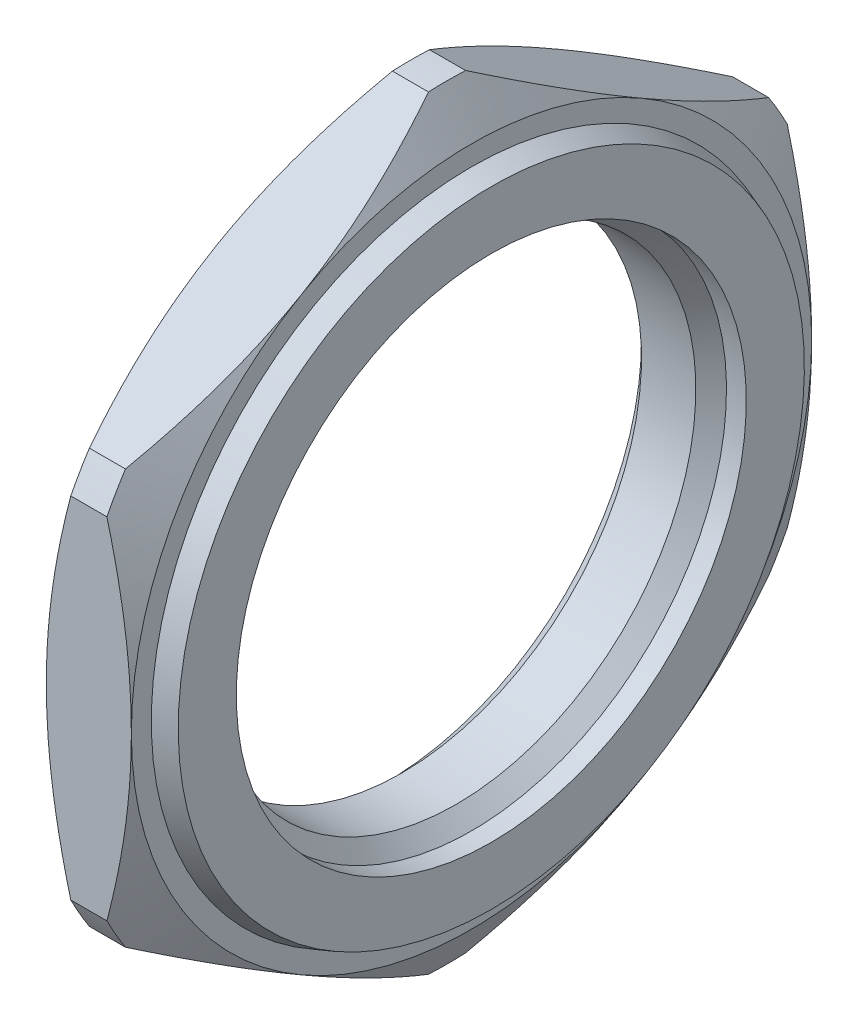
ISO-10303-21;
HEADER;
FILE_DESCRIPTION(('STEP AP214'),'2;1');
FILE_NAME('part.step','',(''),(''),'','','');
FILE_SCHEMA(('AUTOMOTIVE_DESIGN { 1 0 10303 214 1 1 1 1 }'));
ENDSEC;
DATA;
#1=APPLICATION_CONTEXT('core data for automotive mechanical design processes');
#2=APPLICATION_PROTOCOL_DEFINITION('international standard','automotive_design',2000,#1);
#3=PRODUCT_CONTEXT('',#1,'mechanical');
#4=PRODUCT('Part','Part','',(#3));
#5=PRODUCT_RELATED_PRODUCT_CATEGORY('part','',(#4));
#6=PRODUCT_DEFINITION_FORMATION('','',#4);
#7=PRODUCT_DEFINITION_CONTEXT('part definition',#1,'design');
#8=PRODUCT_DEFINITION('design','',#6,#7);
#9=PRODUCT_DEFINITION_SHAPE('','',#8);
#10=(LENGTH_UNIT() NAMED_UNIT(*) SI_UNIT(.MILLI.,.METRE.));
#11=(NAMED_UNIT(*) PLANE_ANGLE_UNIT() SI_UNIT($,.RADIAN.));
#12=(NAMED_UNIT(*) SI_UNIT($,.STERADIAN.) SOLID_ANGLE_UNIT());
#13=UNCERTAINTY_MEASURE_WITH_UNIT(LENGTH_MEASURE(1.E-05),#10,'distance_accuracy_value','');
#14=(GEOMETRIC_REPRESENTATION_CONTEXT(3) GLOBAL_UNCERTAINTY_ASSIGNED_CONTEXT((#13)) GLOBAL_UNIT_ASSIGNED_CONTEXT((#10,
#11,#12)) REPRESENTATION_CONTEXT('',''));
#15=CARTESIAN_POINT('',(0.,0.,0.));
#16=DIRECTION('',(0.,0.,1.));
#17=DIRECTION('',(1.,0.,0.));
#18=AXIS2_PLACEMENT_3D('',#15,#16,#17);
#19=CARTESIAN_POINT('',(-35.4,0.,0.));
#20=DIRECTION('',(1.,0.,0.));
#21=DIRECTION('',(0.,0.,1.));
#22=AXIS2_PLACEMENT_3D('',#19,#20,#21);
#23=PLANE('',#22);
#24=CARTESIAN_POINT('',(-35.4,0.,0.));
#25=DIRECTION('',(-1.,0.,0.));
#26=DIRECTION('',(0.,-1.,0.));
#27=AXIS2_PLACEMENT_3D('',#24,#25,#26);
#28=CIRCLE('',#27,9.);
#29=CARTESIAN_POINT('',(-35.4,9.,0.));
#30=VERTEX_POINT('',#29);
#31=EDGE_CURVE('E273',#30,#30,#28,.T.);
#32=ORIENTED_EDGE('',*,*,#31,.F.);
#33=EDGE_LOOP('',(#32));
#34=FACE_BOUND('',#33,.T.);
#35=CARTESIAN_POINT('',(-35.4,0.,0.));
#36=DIRECTION('',(1.,0.,0.));
#37=DIRECTION('',(0.,-1.,0.));
#38=AXIS2_PLACEMENT_3D('',#35,#36,#37);
#39=CIRCLE('',#38,12.005);
#40=CARTESIAN_POINT('',(-35.4,0.,12.005));
#41=VERTEX_POINT('',#40);
#42=CARTESIAN_POINT('',(-35.4,-10.3966349724322,6.0025));
#43=VERTEX_POINT('',#42);
#44=EDGE_CURVE('E280',#41,#43,#39,.T.);
#45=ORIENTED_EDGE('',*,*,#44,.F.);
#46=CARTESIAN_POINT('',(-35.4,0.,0.));
#47=DIRECTION('',(1.,0.,0.));
#48=DIRECTION('',(0.,-1.,0.));
#49=AXIS2_PLACEMENT_3D('',#46,#47,#48);
#50=CIRCLE('',#49,12.005);
#51=CARTESIAN_POINT('',(-35.4,10.3966349724322,6.0025));
#52=VERTEX_POINT('',#51);
#53=EDGE_CURVE('E340',#52,#41,#50,.T.);
#54=ORIENTED_EDGE('',*,*,#53,.F.);
#55=CARTESIAN_POINT('',(-35.4,0.,0.));
#56=DIRECTION('',(1.,0.,0.));
#57=DIRECTION('',(0.,-1.,0.));
#58=AXIS2_PLACEMENT_3D('',#55,#56,#57);
#59=CIRCLE('',#58,12.005);
#60=CARTESIAN_POINT('',(-35.4,10.3966349724322,-6.0025));
#61=VERTEX_POINT('',#60);
#62=EDGE_CURVE('E247',#61,#52,#59,.T.);
#63=ORIENTED_EDGE('',*,*,#62,.F.);
#64=CARTESIAN_POINT('',(-35.4,0.,0.));
#65=DIRECTION('',(1.,0.,0.));
#66=DIRECTION('',(0.,-1.,0.));
#67=AXIS2_PLACEMENT_3D('',#64,#65,#66);
#68=CIRCLE('',#67,12.005);
#69=CARTESIAN_POINT('',(-35.4,0.,-12.005));
#70=VERTEX_POINT('',#69);
#71=EDGE_CURVE('E313',#70,#61,#68,.T.);
#72=ORIENTED_EDGE('',*,*,#71,.F.);
#73=CARTESIAN_POINT('',(-35.4,0.,0.));
#74=DIRECTION('',(1.,0.,0.));
#75=DIRECTION('',(0.,-1.,0.));
#76=AXIS2_PLACEMENT_3D('',#73,#74,#75);
#77=CIRCLE('',#76,12.005);
#78=CARTESIAN_POINT('',(-35.4,-10.3966349724322,-6.0025));
#79=VERTEX_POINT('',#78);
#80=EDGE_CURVE('E322',#79,#70,#77,.T.);
#81=ORIENTED_EDGE('',*,*,#80,.F.);
#82=CARTESIAN_POINT('',(-35.4,0.,0.));
#83=DIRECTION('',(1.,0.,0.));
#84=DIRECTION('',(0.,-1.,0.));
#85=AXIS2_PLACEMENT_3D('',#82,#83,#84);
#86=CIRCLE('',#85,12.005);
#87=EDGE_CURVE('E260',#43,#79,#86,.T.);
#88=ORIENTED_EDGE('',*,*,#87,.F.);
#89=EDGE_LOOP('',(#45,#54,#63,#72,#81,#88));
#90=FACE_BOUND('',#89,.T.);
#91=ADVANCED_FACE('F16',(#34,#90),#23,.F.);
#92=CARTESIAN_POINT('',(-32.4,0.,0.));
#93=DIRECTION('',(1.,0.,0.));
#94=DIRECTION('',(0.,0.,1.));
#95=AXIS2_PLACEMENT_3D('',#92,#93,#94);
#96=PLANE('',#95);
#97=CARTESIAN_POINT('',(-32.4,0.,0.));
#98=DIRECTION('',(-1.,0.,0.));
#99=DIRECTION('',(0.,1.,0.));
#100=AXIS2_PLACEMENT_3D('',#97,#98,#99);
#101=CIRCLE('',#100,11.3004280532895);
#102=CARTESIAN_POINT('',(-32.4,-11.3004280532895,0.));
#103=VERTEX_POINT('',#102);
#104=EDGE_CURVE('E320',#103,#103,#101,.T.);
#105=ORIENTED_EDGE('',*,*,#104,.T.);
#106=EDGE_LOOP('',(#105));
#107=FACE_BOUND('',#106,.T.);
#108=CARTESIAN_POINT('',(-32.4,0.,0.));
#109=DIRECTION('',(-1.,0.,0.));
#110=DIRECTION('',(0.,-1.,0.));
#111=AXIS2_PLACEMENT_3D('',#108,#109,#110);
#112=CIRCLE('',#111,12.005);
#113=CARTESIAN_POINT('',(-32.4,10.3966349724322,-6.0025));
#114=VERTEX_POINT('',#113);
#115=CARTESIAN_POINT('',(-32.4,0.,-12.005));
#116=VERTEX_POINT('',#115);
#117=EDGE_CURVE('E438',#114,#116,#112,.T.);
#118=ORIENTED_EDGE('',*,*,#117,.F.);
#119=CARTESIAN_POINT('',(-32.4,0.,0.));
#120=DIRECTION('',(-1.,0.,0.));
#121=DIRECTION('',(0.,-1.,0.));
#122=AXIS2_PLACEMENT_3D('',#119,#120,#121);
#123=CIRCLE('',#122,12.005);
#124=CARTESIAN_POINT('',(-32.4,10.3966349724322,6.0025));
#125=VERTEX_POINT('',#124);
#126=EDGE_CURVE('E291',#125,#114,#123,.T.);
#127=ORIENTED_EDGE('',*,*,#126,.F.);
#128=CARTESIAN_POINT('',(-32.4,0.,0.));
#129=DIRECTION('',(-1.,0.,0.));
#130=DIRECTION('',(0.,-1.,0.));
#131=AXIS2_PLACEMENT_3D('',#128,#129,#130);
#132=CIRCLE('',#131,12.005);
#133=CARTESIAN_POINT('',(-32.4,0.,12.005));
#134=VERTEX_POINT('',#133);
#135=EDGE_CURVE('E419',#134,#125,#132,.T.);
#136=ORIENTED_EDGE('',*,*,#135,.F.);
#137=CARTESIAN_POINT('',(-32.4,0.,0.));
#138=DIRECTION('',(-1.,0.,0.));
#139=DIRECTION('',(0.,-1.,0.));
#140=AXIS2_PLACEMENT_3D('',#137,#138,#139);
#141=CIRCLE('',#140,12.005);
#142=CARTESIAN_POINT('',(-32.4,-10.3966349724322,6.0025));
#143=VERTEX_POINT('',#142);
#144=EDGE_CURVE('E332',#143,#134,#141,.T.);
#145=ORIENTED_EDGE('',*,*,#144,.F.);
#146=CARTESIAN_POINT('',(-32.4,0.,0.));
#147=DIRECTION('',(-1.,0.,0.));
#148=DIRECTION('',(0.,-1.,0.));
#149=AXIS2_PLACEMENT_3D('',#146,#147,#148);
#150=CIRCLE('',#149,12.005);
#151=CARTESIAN_POINT('',(-32.4,-10.3966349724322,-6.0025));
#152=VERTEX_POINT('',#151);
#153=EDGE_CURVE('E363',#152,#143,#150,.T.);
#154=ORIENTED_EDGE('',*,*,#153,.F.);
#155=CARTESIAN_POINT('',(-32.4,0.,0.));
#156=DIRECTION('',(-1.,0.,0.));
#157=DIRECTION('',(0.,-1.,0.));
#158=AXIS2_PLACEMENT_3D('',#155,#156,#157);
#159=CIRCLE('',#158,12.005);
#160=EDGE_CURVE('E29',#116,#152,#159,.T.);
#161=ORIENTED_EDGE('',*,*,#160,.F.);
#162=EDGE_LOOP('',(#118,#127,#136,#145,#154,#161));
#163=FACE_BOUND('',#162,.T.);
#164=ADVANCED_FACE('F645',(#107,#163),#96,.T.);
#165=CARTESIAN_POINT('',(-35.4,-10.3966349724322,-6.0025));
#166=DIRECTION('',(0.,-0.866025403784439,-0.5));
#167=DIRECTION('',(0.,0.5,-0.866025403784439));
#168=AXIS2_PLACEMENT_3D('',#165,#166,#167);
#169=PLANE('',#168);
#170=DIRECTION('',(-1.,0.,0.));
#171=VECTOR('',#170,1.);
#172=CARTESIAN_POINT('',(-33.9,-13.4841086565306,-0.65483871210975));
#173=LINE('',#172,#171);
#174=CARTESIAN_POINT('',(-33.2631386524385,-13.4841086565306,-0.654838712109745));
#175=VERTEX_POINT('',#174);
#176=CARTESIAN_POINT('',(-34.5368613475615,-13.4841086565306,-0.654838712109744));
#177=VERTEX_POINT('',#176);
#178=EDGE_CURVE('E321',#175,#177,#173,.T.);
#179=ORIENTED_EDGE('',*,*,#178,.T.);
#180=CARTESIAN_POINT('',(-35.4,-10.3966349724322,-6.0025));
#181=CARTESIAN_POINT('',(-35.4000000000001,-11.8498842011169,-3.48539849985795));
#182=CARTESIAN_POINT('',(-34.5368613475615,-13.4841086565306,-0.654838712109715));
#183=(BOUNDED_CURVE() B_SPLINE_CURVE(2,(#180,#181,#182),.UNSPECIFIED.,.F.,
.F.) B_SPLINE_CURVE_WITH_KNOTS((3,3),(7.0389113352158,13.3698490724536),
.UNSPECIFIED.) CURVE() GEOMETRIC_REPRESENTATION_ITEM() RATIONAL_B_SPLINE_CURVE((1.,
1.03420222205843,1.00688011797745)) REPRESENTATION_ITEM(''));
#184=EDGE_CURVE('E253',#79,#177,#183,.T.);
#185=ORIENTED_EDGE('',*,*,#184,.F.);
#186=CARTESIAN_POINT('',(-34.5368613475615,-7.30916128833378,-11.3501612878903));
#187=CARTESIAN_POINT('',(-35.4,-8.94338574374757,-8.51960150014206));
#188=CARTESIAN_POINT('',(-35.4,-10.3966349724322,-6.0025));
#189=(BOUNDED_CURVE() B_SPLINE_CURVE(2,(#186,#187,#188),.UNSPECIFIED.,.F.,
.F.) B_SPLINE_CURVE_WITH_KNOTS((3,3),(0.707973597977946,7.0389113352158),
.UNSPECIFIED.) CURVE() GEOMETRIC_REPRESENTATION_ITEM() RATIONAL_B_SPLINE_CURVE((1.00688011797745,
1.03420222205841,1.)) REPRESENTATION_ITEM(''));
#190=CARTESIAN_POINT('',(-34.5368613475615,-7.3091612883338,-11.3501612878903));
#191=VERTEX_POINT('',#190);
#192=EDGE_CURVE('E327',#191,#79,#189,.T.);
#193=ORIENTED_EDGE('',*,*,#192,.F.);
#194=DIRECTION('',(1.,0.,0.));
#195=VECTOR('',#194,1.);
#196=CARTESIAN_POINT('',(-33.9,-7.30916128833381,-11.3501612878903));
#197=LINE('',#196,#195);
#198=CARTESIAN_POINT('',(-33.2631386524385,-7.3091612883338,-11.3501612878903));
#199=VERTEX_POINT('',#198);
#200=EDGE_CURVE('E362',#191,#199,#197,.T.);
#201=ORIENTED_EDGE('',*,*,#200,.T.);
#202=CARTESIAN_POINT('',(-32.4,-10.3966349724322,-6.0025));
#203=CARTESIAN_POINT('',(-32.4,-8.94338574374756,-8.51960150014206));
#204=CARTESIAN_POINT('',(-33.2631386524385,-7.30916128833378,-11.3501612878903));
#205=(BOUNDED_CURVE() B_SPLINE_CURVE(2,(#202,#203,#204),.UNSPECIFIED.,.F.,
.F.) B_SPLINE_CURVE_WITH_KNOTS((3,3),(7.0389113352158,13.3698490724537),
.UNSPECIFIED.) CURVE() GEOMETRIC_REPRESENTATION_ITEM() RATIONAL_B_SPLINE_CURVE((1.,
1.03420222205842,1.00688011797745)) REPRESENTATION_ITEM(''));
#206=EDGE_CURVE('E11',#152,#199,#205,.T.);
#207=ORIENTED_EDGE('',*,*,#206,.F.);
#208=CARTESIAN_POINT('',(-33.2631386524385,-13.4841086565305,-0.654838712109716));
#209=CARTESIAN_POINT('',(-32.4,-11.8498842011169,-3.48539849985795));
#210=CARTESIAN_POINT('',(-32.4,-10.3966349724322,-6.0025));
#211=(BOUNDED_CURVE() B_SPLINE_CURVE(2,(#208,#209,#210),.UNSPECIFIED.,.F.,
.F.) B_SPLINE_CURVE_WITH_KNOTS((3,3),(0.70797359797796,7.0389113352158),
.UNSPECIFIED.) CURVE() GEOMETRIC_REPRESENTATION_ITEM() RATIONAL_B_SPLINE_CURVE((1.00688011797745,
1.03420222205842,1.)) REPRESENTATION_ITEM(''));
#212=EDGE_CURVE('E296',#175,#152,#211,.T.);
#213=ORIENTED_EDGE('',*,*,#212,.F.);
#214=EDGE_LOOP('',(#179,#185,#193,#201,#207,#213));
#215=FACE_BOUND('',#214,.T.);
#216=ADVANCED_FACE('F626',(#215),#169,.T.);
#217=CARTESIAN_POINT('',(-35.4,10.3966349724322,-6.0025));
#218=DIRECTION('',(0.,0.866025403784439,-0.5));
#219=DIRECTION('',(-1.,0.,0.));
#220=AXIS2_PLACEMENT_3D('',#217,#218,#219);
#221=PLANE('',#220);
#222=DIRECTION('',(-1.,0.,0.));
#223=VECTOR('',#222,1.);
#224=CARTESIAN_POINT('',(-33.9,7.30916128833381,-11.3501612878903));
#225=LINE('',#224,#223);
#226=CARTESIAN_POINT('',(-33.2631386524385,7.3091612883338,-11.3501612878903));
#227=VERTEX_POINT('',#226);
#228=CARTESIAN_POINT('',(-34.5368613475615,7.3091612883338,-11.3501612878903));
#229=VERTEX_POINT('',#228);
#230=EDGE_CURVE('E268',#227,#229,#225,.T.);
#231=ORIENTED_EDGE('',*,*,#230,.T.);
#232=CARTESIAN_POINT('',(-35.4,10.3966349724322,-6.0025));
#233=CARTESIAN_POINT('',(-35.4,8.94338574374757,-8.51960150014206));
#234=CARTESIAN_POINT('',(-34.5368613475615,7.30916128833378,-11.3501612878903));
#235=(BOUNDED_CURVE() B_SPLINE_CURVE(2,(#232,#233,#234),.UNSPECIFIED.,.F.,
.F.) B_SPLINE_CURVE_WITH_KNOTS((3,3),(7.0389113352158,13.3698490724536),
.UNSPECIFIED.) CURVE() GEOMETRIC_REPRESENTATION_ITEM() RATIONAL_B_SPLINE_CURVE((1.,
1.03420222205841,1.00688011797745)) REPRESENTATION_ITEM(''));
#236=EDGE_CURVE('E387',#61,#229,#235,.T.);
#237=ORIENTED_EDGE('',*,*,#236,.F.);
#238=CARTESIAN_POINT('',(-34.5368613475615,13.4841086565306,-0.654838712109721));
#239=CARTESIAN_POINT('',(-35.4,11.8498842011169,-3.48539849985796));
#240=CARTESIAN_POINT('',(-35.4,10.3966349724322,-6.0025));
#241=(BOUNDED_CURVE() B_SPLINE_CURVE(2,(#238,#239,#240),.UNSPECIFIED.,.F.,
.F.) B_SPLINE_CURVE_WITH_KNOTS((3,3),(0.707973597977971,7.0389113352158),
.UNSPECIFIED.) CURVE() GEOMETRIC_REPRESENTATION_ITEM() RATIONAL_B_SPLINE_CURVE((1.00688011797745,
1.03420222205841,1.)) REPRESENTATION_ITEM(''));
#242=CARTESIAN_POINT('',(-34.5368613475615,13.4841086565306,-0.654838712109752));
#243=VERTEX_POINT('',#242);
#244=EDGE_CURVE('E235',#243,#61,#241,.T.);
#245=ORIENTED_EDGE('',*,*,#244,.F.);
#246=DIRECTION('',(1.,0.,0.));
#247=VECTOR('',#246,1.);
#248=CARTESIAN_POINT('',(-33.9,13.4841086565306,-0.654838712109762));
#249=LINE('',#248,#247);
#250=CARTESIAN_POINT('',(-33.2631386524385,13.4841086565306,-0.654838712109745));
#251=VERTEX_POINT('',#250);
#252=EDGE_CURVE('E234',#243,#251,#249,.T.);
#253=ORIENTED_EDGE('',*,*,#252,.T.);
#254=CARTESIAN_POINT('',(-32.4,10.3966349724322,-6.0025));
#255=CARTESIAN_POINT('',(-32.4,11.8498842011168,-3.48539849985797));
#256=CARTESIAN_POINT('',(-33.2631386524386,13.4841086565306,-0.654838712109721));
#257=(BOUNDED_CURVE() B_SPLINE_CURVE(2,(#254,#255,#256),.UNSPECIFIED.,.F.,
.F.) B_SPLINE_CURVE_WITH_KNOTS((3,3),(7.0389113352158,13.3698490724536),
.UNSPECIFIED.) CURVE() GEOMETRIC_REPRESENTATION_ITEM() RATIONAL_B_SPLINE_CURVE((1.,
1.03420222205841,1.00688011797744)) REPRESENTATION_ITEM(''));
#258=EDGE_CURVE('E295',#114,#251,#257,.T.);
#259=ORIENTED_EDGE('',*,*,#258,.F.);
#260=CARTESIAN_POINT('',(-33.2631386524386,7.30916128833379,-11.3501612878903));
#261=CARTESIAN_POINT('',(-32.4,8.94338574374756,-8.51960150014205));
#262=CARTESIAN_POINT('',(-32.4,10.3966349724322,-6.0025));
#263=(BOUNDED_CURVE() B_SPLINE_CURVE(2,(#260,#261,#262),.UNSPECIFIED.,.F.,
.F.) B_SPLINE_CURVE_WITH_KNOTS((3,3),(0.707973597977953,7.0389113352158),
.UNSPECIFIED.) CURVE() GEOMETRIC_REPRESENTATION_ITEM() RATIONAL_B_SPLINE_CURVE((1.00688011797744,
1.03420222205841,1.)) REPRESENTATION_ITEM(''));
#264=EDGE_CURVE('E326',#227,#114,#263,.T.);
#265=ORIENTED_EDGE('',*,*,#264,.F.);
#266=EDGE_LOOP('',(#231,#237,#245,#253,#259,#265));
#267=FACE_BOUND('',#266,.T.);
#268=ADVANCED_FACE('F576',(#267),#221,.T.);
#269=CARTESIAN_POINT('',(-35.4,-10.3966349724322,6.0025));
#270=DIRECTION('',(0.,-0.866025403784439,0.5));
#271=DIRECTION('',(-1.,0.,0.));
#272=AXIS2_PLACEMENT_3D('',#269,#270,#271);
#273=PLANE('',#272);
#274=DIRECTION('',(-1.,0.,0.));
#275=VECTOR('',#274,1.);
#276=CARTESIAN_POINT('',(-33.9,-7.30916128833381,11.3501612878902));
#277=LINE('',#276,#275);
#278=CARTESIAN_POINT('',(-33.2631386524385,-7.30916128833381,11.3501612878902));
#279=VERTEX_POINT('',#278);
#280=CARTESIAN_POINT('',(-34.5368613475615,-7.3091612883338,11.3501612878903));
#281=VERTEX_POINT('',#280);
#282=EDGE_CURVE('E454',#279,#281,#277,.T.);
#283=ORIENTED_EDGE('',*,*,#282,.T.);
#284=CARTESIAN_POINT('',(-35.4,-10.3966349724322,6.0025));
#285=CARTESIAN_POINT('',(-35.4,-8.94338574374756,8.51960150014205));
#286=CARTESIAN_POINT('',(-34.5368613475614,-7.30916128833376,11.3501612878903));
#287=(BOUNDED_CURVE() B_SPLINE_CURVE(2,(#284,#285,#286),.UNSPECIFIED.,.F.,
.F.) B_SPLINE_CURVE_WITH_KNOTS((3,3),(7.0389113352158,13.3698490724537),
.UNSPECIFIED.) CURVE() GEOMETRIC_REPRESENTATION_ITEM() RATIONAL_B_SPLINE_CURVE((1.,
1.03420222205842,1.00688011797745)) REPRESENTATION_ITEM(''));
#288=EDGE_CURVE('E407',#43,#281,#287,.T.);
#289=ORIENTED_EDGE('',*,*,#288,.F.);
#290=CARTESIAN_POINT('',(-34.5368613475615,-13.4841086565306,0.65483871210971));
#291=CARTESIAN_POINT('',(-35.4,-11.8498842011168,3.48539849985794));
#292=CARTESIAN_POINT('',(-35.4,-10.3966349724322,6.0025));
#293=(BOUNDED_CURVE() B_SPLINE_CURVE(2,(#290,#291,#292),.UNSPECIFIED.,.F.,
.F.) B_SPLINE_CURVE_WITH_KNOTS((3,3),(0.707973597977949,7.0389113352158),
.UNSPECIFIED.) CURVE() GEOMETRIC_REPRESENTATION_ITEM() RATIONAL_B_SPLINE_CURVE((1.00688011797745,
1.03420222205844,1.)) REPRESENTATION_ITEM(''));
#294=CARTESIAN_POINT('',(-34.5368613475615,-13.4841086565306,0.654838712109739));
#295=VERTEX_POINT('',#294);
#296=EDGE_CURVE('E534',#295,#43,#293,.T.);
#297=ORIENTED_EDGE('',*,*,#296,.F.);
#298=DIRECTION('',(1.,0.,0.));
#299=VECTOR('',#298,1.);
#300=CARTESIAN_POINT('',(-33.9,-13.4841086565306,0.654838712109749));
#301=LINE('',#300,#299);
#302=CARTESIAN_POINT('',(-33.2631386524385,-13.4841086565306,0.654838712109738));
#303=VERTEX_POINT('',#302);
#304=EDGE_CURVE('E442',#295,#303,#301,.T.);
#305=ORIENTED_EDGE('',*,*,#304,.T.);
#306=CARTESIAN_POINT('',(-32.4,-10.3966349724322,6.0025));
#307=CARTESIAN_POINT('',(-32.4,-11.8498842011169,3.48539849985795));
#308=CARTESIAN_POINT('',(-33.2631386524385,-13.4841086565305,0.654838712109709));
#309=(BOUNDED_CURVE() B_SPLINE_CURVE(2,(#306,#307,#308),.UNSPECIFIED.,.F.,
.F.) B_SPLINE_CURVE_WITH_KNOTS((3,3),(7.0389113352158,13.3698490724536),
.UNSPECIFIED.) CURVE() GEOMETRIC_REPRESENTATION_ITEM() RATIONAL_B_SPLINE_CURVE((1.,
1.03420222205842,1.00688011797745)) REPRESENTATION_ITEM(''));
#310=EDGE_CURVE('E366',#143,#303,#309,.T.);
#311=ORIENTED_EDGE('',*,*,#310,.F.);
#312=CARTESIAN_POINT('',(-33.2631386524385,-7.30916128833382,11.3501612878902));
#313=CARTESIAN_POINT('',(-32.4,-8.94338574374759,8.51960150014202));
#314=CARTESIAN_POINT('',(-32.4,-10.3966349724322,6.0025));
#315=(BOUNDED_CURVE() B_SPLINE_CURVE(2,(#312,#313,#314),.UNSPECIFIED.,.F.,
.F.) B_SPLINE_CURVE_WITH_KNOTS((3,3),(0.707973597978025,7.0389113352158),
.UNSPECIFIED.) CURVE() GEOMETRIC_REPRESENTATION_ITEM() RATIONAL_B_SPLINE_CURVE((1.00688011797745,
1.03420222205841,1.)) REPRESENTATION_ITEM(''));
#316=EDGE_CURVE('E510',#279,#143,#315,.T.);
#317=ORIENTED_EDGE('',*,*,#316,.F.);
#318=EDGE_LOOP('',(#283,#289,#297,#305,#311,#317));
#319=FACE_BOUND('',#318,.T.);
#320=ADVANCED_FACE('F614',(#319),#273,.T.);
#321=CARTESIAN_POINT('',(-35.4,10.3966349724322,6.0025));
#322=DIRECTION('',(0.,0.866025403784439,0.5));
#323=DIRECTION('',(1.,0.,0.));
#324=AXIS2_PLACEMENT_3D('',#321,#322,#323);
#325=PLANE('',#324);
#326=DIRECTION('',(-1.,0.,0.));
#327=VECTOR('',#326,1.);
#328=CARTESIAN_POINT('',(-33.9,13.4841086565306,0.654838712109743));
#329=LINE('',#328,#327);
#330=CARTESIAN_POINT('',(-33.2631386524385,13.4841086565306,0.654838712109737));
#331=VERTEX_POINT('',#330);
#332=CARTESIAN_POINT('',(-34.5368613475615,13.4841086565306,0.654838712109734));
#333=VERTEX_POINT('',#332);
#334=EDGE_CURVE('E223',#331,#333,#329,.T.);
#335=ORIENTED_EDGE('',*,*,#334,.T.);
#336=CARTESIAN_POINT('',(-35.4,10.3966349724322,6.0025));
#337=CARTESIAN_POINT('',(-35.4,11.8498842011169,3.48539849985795));
#338=CARTESIAN_POINT('',(-34.5368613475615,13.4841086565306,0.654838712109704));
#339=(BOUNDED_CURVE() B_SPLINE_CURVE(2,(#336,#337,#338),.UNSPECIFIED.,.F.,
.F.) B_SPLINE_CURVE_WITH_KNOTS((3,3),(7.0389113352158,13.3698490724536),
.UNSPECIFIED.) CURVE() GEOMETRIC_REPRESENTATION_ITEM() RATIONAL_B_SPLINE_CURVE((1.,
1.03420222205841,1.00688011797745)) REPRESENTATION_ITEM(''));
#340=EDGE_CURVE('E20',#52,#333,#339,.T.);
#341=ORIENTED_EDGE('',*,*,#340,.F.);
#342=CARTESIAN_POINT('',(-34.5368613475615,7.30916128833382,11.3501612878902));
#343=CARTESIAN_POINT('',(-35.4,8.94338574374758,8.51960150014201));
#344=CARTESIAN_POINT('',(-35.4,10.3966349724322,6.0025));
#345=(BOUNDED_CURVE() B_SPLINE_CURVE(2,(#342,#343,#344),.UNSPECIFIED.,.F.,
.F.) B_SPLINE_CURVE_WITH_KNOTS((3,3),(0.70797359797802,7.0389113352158),
.UNSPECIFIED.) CURVE() GEOMETRIC_REPRESENTATION_ITEM() RATIONAL_B_SPLINE_CURVE((1.00688011797745,
1.03420222205842,1.)) REPRESENTATION_ITEM(''));
#346=CARTESIAN_POINT('',(-34.5368613475615,7.30916128833382,11.3501612878902));
#347=VERTEX_POINT('',#346);
#348=EDGE_CURVE('E347',#347,#52,#345,.T.);
#349=ORIENTED_EDGE('',*,*,#348,.F.);
#350=DIRECTION('',(1.,0.,0.));
#351=VECTOR('',#350,1.);
#352=CARTESIAN_POINT('',(-33.9,7.30916128833382,11.3501612878902));
#353=LINE('',#352,#351);
#354=CARTESIAN_POINT('',(-33.2631386524385,7.30916128833381,11.3501612878902));
#355=VERTEX_POINT('',#354);
#356=EDGE_CURVE('E437',#347,#355,#353,.T.);
#357=ORIENTED_EDGE('',*,*,#356,.T.);
#358=CARTESIAN_POINT('',(-32.4,10.3966349724322,6.0025));
#359=CARTESIAN_POINT('',(-32.4,8.94338574374759,8.51960150014202));
#360=CARTESIAN_POINT('',(-33.2631386524385,7.30916128833383,11.3501612878902));
#361=(BOUNDED_CURVE() B_SPLINE_CURVE(2,(#358,#359,#360),.UNSPECIFIED.,.F.,
.F.) B_SPLINE_CURVE_WITH_KNOTS((3,3),(7.0389113352158,13.3698490724536),
.UNSPECIFIED.) CURVE() GEOMETRIC_REPRESENTATION_ITEM() RATIONAL_B_SPLINE_CURVE((1.,
1.03420222205841,1.00688011797745)) REPRESENTATION_ITEM(''));
#362=EDGE_CURVE('E423',#125,#355,#361,.T.);
#363=ORIENTED_EDGE('',*,*,#362,.F.);
#364=CARTESIAN_POINT('',(-33.2631386524385,13.4841086565306,0.654838712109708));
#365=CARTESIAN_POINT('',(-32.4,11.8498842011169,3.48539849985795));
#366=CARTESIAN_POINT('',(-32.4,10.3966349724322,6.0025));
#367=(BOUNDED_CURVE() B_SPLINE_CURVE(2,(#364,#365,#366),.UNSPECIFIED.,.F.,
.F.) B_SPLINE_CURVE_WITH_KNOTS((3,3),(0.707973597977968,7.0389113352158),
.UNSPECIFIED.) CURVE() GEOMETRIC_REPRESENTATION_ITEM() RATIONAL_B_SPLINE_CURVE((1.00688011797745,
1.03420222205841,1.)) REPRESENTATION_ITEM(''));
#368=EDGE_CURVE('E229',#331,#125,#367,.T.);
#369=ORIENTED_EDGE('',*,*,#368,.F.);
#370=EDGE_LOOP('',(#335,#341,#349,#357,#363,#369));
#371=FACE_BOUND('',#370,.T.);
#372=ADVANCED_FACE('F225',(#371),#325,.T.);
#373=CARTESIAN_POINT('',(-35.4,0.,12.005));
#374=DIRECTION('',(0.,0.,1.));
#375=DIRECTION('',(0.,-1.,0.));
#376=AXIS2_PLACEMENT_3D('',#373,#374,#375);
#377=PLANE('',#376);
#378=DIRECTION('',(-1.,0.,0.));
#379=VECTOR('',#378,1.);
#380=CARTESIAN_POINT('',(-33.9,6.17494736819676,12.005));
#381=LINE('',#380,#379);
#382=CARTESIAN_POINT('',(-33.2631386524385,6.17494736819676,12.005));
#383=VERTEX_POINT('',#382);
#384=CARTESIAN_POINT('',(-34.5368613475615,6.17494736819676,12.005));
#385=VERTEX_POINT('',#384);
#386=EDGE_CURVE('E282',#383,#385,#381,.T.);
#387=ORIENTED_EDGE('',*,*,#386,.T.);
#388=CARTESIAN_POINT('',(-35.4,0.,12.005));
#389=CARTESIAN_POINT('',(-35.4,2.90649845736923,12.005));
#390=CARTESIAN_POINT('',(-34.5368613475616,6.17494736819678,12.005));
#391=(BOUNDED_CURVE() B_SPLINE_CURVE(2,(#388,#389,#390),.UNSPECIFIED.,.F.,
.F.) B_SPLINE_CURVE_WITH_KNOTS((3,3),(7.0389113352158,13.3698490724536),
.UNSPECIFIED.) CURVE() GEOMETRIC_REPRESENTATION_ITEM() RATIONAL_B_SPLINE_CURVE((1.,
1.03420222205841,1.00688011797745)) REPRESENTATION_ITEM(''));
#392=EDGE_CURVE('E281',#41,#385,#391,.T.);
#393=ORIENTED_EDGE('',*,*,#392,.F.);
#394=CARTESIAN_POINT('',(-34.5368613475616,-6.17494736819679,12.005));
#395=CARTESIAN_POINT('',(-35.4,-2.90649845736923,12.005));
#396=CARTESIAN_POINT('',(-35.4,0.,12.005));
#397=(BOUNDED_CURVE() B_SPLINE_CURVE(2,(#394,#395,#396),.UNSPECIFIED.,.F.,
.F.) B_SPLINE_CURVE_WITH_KNOTS((3,3),(0.707973597977979,7.0389113352158),
.UNSPECIFIED.) CURVE() GEOMETRIC_REPRESENTATION_ITEM() RATIONAL_B_SPLINE_CURVE((1.00688011797745,
1.03420222205841,1.)) REPRESENTATION_ITEM(''));
#398=CARTESIAN_POINT('',(-34.5368613475615,-6.17494736819677,12.005));
#399=VERTEX_POINT('',#398);
#400=EDGE_CURVE('E274',#399,#41,#397,.T.);
#401=ORIENTED_EDGE('',*,*,#400,.F.);
#402=DIRECTION('',(1.,0.,0.));
#403=VECTOR('',#402,1.);
#404=CARTESIAN_POINT('',(-33.9,-6.17494736819675,12.005));
#405=LINE('',#404,#403);
#406=CARTESIAN_POINT('',(-33.2631386524385,-6.17494736819677,12.005));
#407=VERTEX_POINT('',#406);
#408=EDGE_CURVE('E414',#399,#407,#405,.T.);
#409=ORIENTED_EDGE('',*,*,#408,.T.);
#410=CARTESIAN_POINT('',(-32.4,0.,12.005));
#411=CARTESIAN_POINT('',(-32.4,-2.90649845736923,12.005));
#412=CARTESIAN_POINT('',(-33.2631386524385,-6.17494736819679,12.005));
#413=(BOUNDED_CURVE() B_SPLINE_CURVE(2,(#410,#411,#412),.UNSPECIFIED.,.F.,
.F.) B_SPLINE_CURVE_WITH_KNOTS((3,3),(7.0389113352158,13.3698490724536),
.UNSPECIFIED.) CURVE() GEOMETRIC_REPRESENTATION_ITEM() RATIONAL_B_SPLINE_CURVE((1.,
1.03420222205841,1.00688011797745)) REPRESENTATION_ITEM(''));
#414=EDGE_CURVE('E43',#134,#407,#413,.T.);
#415=ORIENTED_EDGE('',*,*,#414,.F.);
#416=CARTESIAN_POINT('',(-33.2631386524385,6.17494736819678,12.005));
#417=CARTESIAN_POINT('',(-32.4,2.90649845736923,12.005));
#418=CARTESIAN_POINT('',(-32.4,0.,12.005));
#419=(BOUNDED_CURVE() B_SPLINE_CURVE(2,(#416,#417,#418),.UNSPECIFIED.,.F.,
.F.) B_SPLINE_CURVE_WITH_KNOTS((3,3),(0.707973597977997,7.0389113352158),
.UNSPECIFIED.) CURVE() GEOMETRIC_REPRESENTATION_ITEM() RATIONAL_B_SPLINE_CURVE((1.00688011797745,
1.03420222205841,1.)) REPRESENTATION_ITEM(''));
#420=EDGE_CURVE('E424',#383,#134,#419,.T.);
#421=ORIENTED_EDGE('',*,*,#420,.F.);
#422=EDGE_LOOP('',(#387,#393,#401,#409,#415,#421));
#423=FACE_BOUND('',#422,.T.);
#424=ADVANCED_FACE('F637',(#423),#377,.T.);
#425=CARTESIAN_POINT('',(-32.9371594735757,0.,0.));
#426=DIRECTION('',(-1.,0.,0.));
#427=DIRECTION('',(0.,-1.,0.));
#428=AXIS2_PLACEMENT_3D('',#425,#426,#427);
#429=CONICAL_SURFACE('',#428,12.9353875,1.0471975511966);
#430=CARTESIAN_POINT('',(-33.2631386524385,0.,0.));
#431=DIRECTION('',(1.,0.,0.));
#432=DIRECTION('',(0.,-1.,0.));
#433=AXIS2_PLACEMENT_3D('',#430,#431,#432);
#434=CIRCLE('',#433,13.5);
#435=CARTESIAN_POINT('',(-33.2631386524385,-6.17494736819677,-12.005));
#436=VERTEX_POINT('',#435);
#437=EDGE_CURVE('E359',#199,#436,#434,.T.);
#438=ORIENTED_EDGE('',*,*,#437,.T.);
#439=CARTESIAN_POINT('',(-33.2631386524385,-6.17494736819677,-12.005));
#440=CARTESIAN_POINT('',(-32.4,-2.90649845736923,-12.005));
#441=CARTESIAN_POINT('',(-32.4,0.,-12.005));
#442=(BOUNDED_CURVE() B_SPLINE_CURVE(2,(#439,#440,#441),.UNSPECIFIED.,.F.,
.F.) B_SPLINE_CURVE_WITH_KNOTS((3,3),(0.707973597977975,7.0389113352158),
.UNSPECIFIED.) CURVE() GEOMETRIC_REPRESENTATION_ITEM() RATIONAL_B_SPLINE_CURVE((1.00688011797745,
1.03420222205842,1.)) REPRESENTATION_ITEM(''));
#443=EDGE_CURVE('E425',#436,#116,#442,.T.);
#444=ORIENTED_EDGE('',*,*,#443,.T.);
#445=ORIENTED_EDGE('',*,*,#160,.T.);
#446=ORIENTED_EDGE('',*,*,#206,.T.);
#447=EDGE_LOOP('',(#438,#444,#445,#446));
#448=FACE_BOUND('',#447,.T.);
#449=ADVANCED_FACE('F721',(#448),#429,.T.);
#450=CARTESIAN_POINT('',(-32.9371594735757,0.,0.));
#451=DIRECTION('',(-1.,0.,0.));
#452=DIRECTION('',(0.,-1.,0.));
#453=AXIS2_PLACEMENT_3D('',#450,#451,#452);
#454=CONICAL_SURFACE('',#453,12.9353875,1.0471975511966);
#455=CARTESIAN_POINT('',(-33.2631386524385,0.,0.));
#456=DIRECTION('',(1.,0.,0.));
#457=DIRECTION('',(0.,-1.,0.));
#458=AXIS2_PLACEMENT_3D('',#455,#456,#457);
#459=CIRCLE('',#458,13.5);
#460=EDGE_CURVE('E418',#407,#279,#459,.T.);
#461=ORIENTED_EDGE('',*,*,#460,.T.);
#462=ORIENTED_EDGE('',*,*,#316,.T.);
#463=ORIENTED_EDGE('',*,*,#144,.T.);
#464=ORIENTED_EDGE('',*,*,#414,.T.);
#465=EDGE_LOOP('',(#461,#462,#463,#464));
#466=FACE_BOUND('',#465,.T.);
#467=ADVANCED_FACE('F635',(#466),#454,.T.);
#468=CARTESIAN_POINT('',(-32.9371594735757,0.,0.));
#469=DIRECTION('',(-1.,0.,0.));
#470=DIRECTION('',(0.,-1.,0.));
#471=AXIS2_PLACEMENT_3D('',#468,#469,#470);
#472=CONICAL_SURFACE('',#471,12.9353875,1.0471975511966);
#473=CARTESIAN_POINT('',(-33.2631386524385,0.,0.));
#474=DIRECTION('',(1.,0.,0.));
#475=DIRECTION('',(0.,-1.,0.));
#476=AXIS2_PLACEMENT_3D('',#473,#474,#475);
#477=CIRCLE('',#476,13.5);
#478=EDGE_CURVE('E458',#355,#383,#477,.T.);
#479=ORIENTED_EDGE('',*,*,#478,.T.);
#480=ORIENTED_EDGE('',*,*,#420,.T.);
#481=ORIENTED_EDGE('',*,*,#135,.T.);
#482=ORIENTED_EDGE('',*,*,#362,.T.);
#483=EDGE_LOOP('',(#479,#480,#481,#482));
#484=FACE_BOUND('',#483,.T.);
#485=ADVANCED_FACE('F643',(#484),#472,.T.);
#486=CARTESIAN_POINT('',(-32.9371594735757,0.,0.));
#487=DIRECTION('',(-1.,0.,0.));
#488=DIRECTION('',(0.,-1.,0.));
#489=AXIS2_PLACEMENT_3D('',#486,#487,#488);
#490=CONICAL_SURFACE('',#489,12.9353875,1.0471975511966);
#491=CARTESIAN_POINT('',(-33.2631386524385,0.,0.));
#492=DIRECTION('',(1.,0.,0.));
#493=DIRECTION('',(0.,-1.,0.));
#494=AXIS2_PLACEMENT_3D('',#491,#492,#493);
#495=CIRCLE('',#494,13.5);
#496=CARTESIAN_POINT('',(-33.2631386524385,6.17494736819677,-12.005));
#497=VERTEX_POINT('',#496);
#498=EDGE_CURVE('E289',#497,#227,#495,.T.);
#499=ORIENTED_EDGE('',*,*,#498,.T.);
#500=ORIENTED_EDGE('',*,*,#264,.T.);
#501=ORIENTED_EDGE('',*,*,#117,.T.);
#502=CARTESIAN_POINT('',(-32.4,0.,-12.005));
#503=CARTESIAN_POINT('',(-32.4,2.90649845736923,-12.005));
#504=CARTESIAN_POINT('',(-33.2631386524385,6.17494736819677,-12.005));
#505=(BOUNDED_CURVE() B_SPLINE_CURVE(2,(#502,#503,#504),.UNSPECIFIED.,.F.,
.F.) B_SPLINE_CURVE_WITH_KNOTS((3,3),(7.0389113352158,13.3698490724536),
.UNSPECIFIED.) CURVE() GEOMETRIC_REPRESENTATION_ITEM() RATIONAL_B_SPLINE_CURVE((1.,
1.03420222205842,1.00688011797745)) REPRESENTATION_ITEM(''));
#506=EDGE_CURVE('E431',#116,#497,#505,.T.);
#507=ORIENTED_EDGE('',*,*,#506,.T.);
#508=EDGE_LOOP('',(#499,#500,#501,#507));
#509=FACE_BOUND('',#508,.T.);
#510=ADVANCED_FACE('F648',(#509),#490,.T.);
#511=CARTESIAN_POINT('',(-34.8628405264243,0.,0.));
#512=DIRECTION('',(1.,0.,0.));
#513=DIRECTION('',(0.,-1.,0.));
#514=AXIS2_PLACEMENT_3D('',#511,#512,#513);
#515=CONICAL_SURFACE('',#514,12.9353875,1.0471975511966);
#516=CARTESIAN_POINT('',(-34.5368613475615,0.,0.));
#517=DIRECTION('',(-1.,0.,0.));
#518=DIRECTION('',(0.,-1.,0.));
#519=AXIS2_PLACEMENT_3D('',#516,#517,#518);
#520=CIRCLE('',#519,13.5);
#521=CARTESIAN_POINT('',(-34.5368613475615,-6.17494736819676,-12.005));
#522=VERTEX_POINT('',#521);
#523=EDGE_CURVE('E404',#522,#191,#520,.T.);
#524=ORIENTED_EDGE('',*,*,#523,.T.);
#525=ORIENTED_EDGE('',*,*,#192,.T.);
#526=ORIENTED_EDGE('',*,*,#80,.T.);
#527=CARTESIAN_POINT('',(-35.4,0.,-12.005));
#528=CARTESIAN_POINT('',(-35.4,-2.90649845736922,-12.005));
#529=CARTESIAN_POINT('',(-34.5368613475615,-6.17494736819677,-12.005));
#530=(BOUNDED_CURVE() B_SPLINE_CURVE(2,(#527,#528,#529),.UNSPECIFIED.,.F.,
.F.) B_SPLINE_CURVE_WITH_KNOTS((3,3),(7.0389113352158,13.3698490724536),
.UNSPECIFIED.) CURVE() GEOMETRIC_REPRESENTATION_ITEM() RATIONAL_B_SPLINE_CURVE((1.,
1.03420222205841,1.00688011797745)) REPRESENTATION_ITEM(''));
#531=EDGE_CURVE('E353',#70,#522,#530,.T.);
#532=ORIENTED_EDGE('',*,*,#531,.T.);
#533=EDGE_LOOP('',(#524,#525,#526,#532));
#534=FACE_BOUND('',#533,.T.);
#535=ADVANCED_FACE('F622',(#534),#515,.T.);
#536=CARTESIAN_POINT('',(-35.4,0.,-12.005));
#537=DIRECTION('',(0.,0.,-1.));
#538=DIRECTION('',(0.,-1.,0.));
#539=AXIS2_PLACEMENT_3D('',#536,#537,#538);
#540=PLANE('',#539);
#541=DIRECTION('',(1.,0.,0.));
#542=VECTOR('',#541,1.);
#543=CARTESIAN_POINT('',(-33.9,6.17494736819675,-12.005));
#544=LINE('',#543,#542);
#545=CARTESIAN_POINT('',(-34.5368613475615,6.17494736819676,-12.005));
#546=VERTEX_POINT('',#545);
#547=EDGE_CURVE('E269',#546,#497,#544,.T.);
#548=ORIENTED_EDGE('',*,*,#547,.T.);
#549=ORIENTED_EDGE('',*,*,#506,.F.);
#550=ORIENTED_EDGE('',*,*,#443,.F.);
#551=DIRECTION('',(-1.,0.,0.));
#552=VECTOR('',#551,1.);
#553=CARTESIAN_POINT('',(-33.9,-6.17494736819675,-12.005));
#554=LINE('',#553,#552);
#555=EDGE_CURVE('E450',#436,#522,#554,.T.);
#556=ORIENTED_EDGE('',*,*,#555,.T.);
#557=ORIENTED_EDGE('',*,*,#531,.F.);
#558=CARTESIAN_POINT('',(-34.5368613475615,6.17494736819677,-12.005));
#559=CARTESIAN_POINT('',(-35.4,2.90649845736922,-12.005));
#560=CARTESIAN_POINT('',(-35.4,0.,-12.005));
#561=(BOUNDED_CURVE() B_SPLINE_CURVE(2,(#558,#559,#560),.UNSPECIFIED.,.F.,
.F.) B_SPLINE_CURVE_WITH_KNOTS((3,3),(0.707973597977993,7.0389113352158),
.UNSPECIFIED.) CURVE() GEOMETRIC_REPRESENTATION_ITEM() RATIONAL_B_SPLINE_CURVE((1.00688011797745,
1.03420222205841,1.)) REPRESENTATION_ITEM(''));
#562=EDGE_CURVE('E304',#546,#70,#561,.T.);
#563=ORIENTED_EDGE('',*,*,#562,.F.);
#564=EDGE_LOOP('',(#548,#549,#550,#556,#557,#563));
#565=FACE_BOUND('',#564,.T.);
#566=ADVANCED_FACE('F786',(#565),#540,.T.);
#567=CARTESIAN_POINT('',(-34.8628405264243,0.,0.));
#568=DIRECTION('',(1.,0.,0.));
#569=DIRECTION('',(0.,-1.,0.));
#570=AXIS2_PLACEMENT_3D('',#567,#568,#569);
#571=CONICAL_SURFACE('',#570,12.9353875,1.0471975511966);
#572=CARTESIAN_POINT('',(-34.5368613475615,0.,0.));
#573=DIRECTION('',(-1.,0.,0.));
#574=DIRECTION('',(0.,-1.,0.));
#575=AXIS2_PLACEMENT_3D('',#572,#573,#574);
#576=CIRCLE('',#575,13.5);
#577=EDGE_CURVE('E417',#281,#399,#576,.T.);
#578=ORIENTED_EDGE('',*,*,#577,.T.);
#579=ORIENTED_EDGE('',*,*,#400,.T.);
#580=ORIENTED_EDGE('',*,*,#44,.T.);
#581=ORIENTED_EDGE('',*,*,#288,.T.);
#582=EDGE_LOOP('',(#578,#579,#580,#581));
#583=FACE_BOUND('',#582,.T.);
#584=ADVANCED_FACE('F618',(#583),#571,.T.);
#585=CARTESIAN_POINT('',(-34.8628405264243,0.,0.));
#586=DIRECTION('',(1.,0.,0.));
#587=DIRECTION('',(0.,-1.,0.));
#588=AXIS2_PLACEMENT_3D('',#585,#586,#587);
#589=CONICAL_SURFACE('',#588,12.9353875,1.0471975511966);
#590=CARTESIAN_POINT('',(-34.5368613475615,0.,0.));
#591=DIRECTION('',(-1.,0.,0.));
#592=DIRECTION('',(0.,-1.,0.));
#593=AXIS2_PLACEMENT_3D('',#590,#591,#592);
#594=CIRCLE('',#593,13.5);
#595=EDGE_CURVE('E290',#385,#347,#594,.T.);
#596=ORIENTED_EDGE('',*,*,#595,.T.);
#597=ORIENTED_EDGE('',*,*,#348,.T.);
#598=ORIENTED_EDGE('',*,*,#53,.T.);
#599=ORIENTED_EDGE('',*,*,#392,.T.);
#600=EDGE_LOOP('',(#596,#597,#598,#599));
#601=FACE_BOUND('',#600,.T.);
#602=ADVANCED_FACE('F382',(#601),#589,.T.);
#603=CARTESIAN_POINT('',(-34.8628405264243,0.,0.));
#604=DIRECTION('',(1.,0.,0.));
#605=DIRECTION('',(0.,-1.,0.));
#606=AXIS2_PLACEMENT_3D('',#603,#604,#605);
#607=CONICAL_SURFACE('',#606,12.9353875,1.0471975511966);
#608=CARTESIAN_POINT('',(-34.5368613475615,0.,0.));
#609=DIRECTION('',(-1.,0.,0.));
#610=DIRECTION('',(0.,-1.,0.));
#611=AXIS2_PLACEMENT_3D('',#608,#609,#610);
#612=CIRCLE('',#611,13.5);
#613=EDGE_CURVE('E265',#229,#546,#612,.T.);
#614=ORIENTED_EDGE('',*,*,#613,.T.);
#615=ORIENTED_EDGE('',*,*,#562,.T.);
#616=ORIENTED_EDGE('',*,*,#71,.T.);
#617=ORIENTED_EDGE('',*,*,#236,.T.);
#618=EDGE_LOOP('',(#614,#615,#616,#617));
#619=FACE_BOUND('',#618,.T.);
#620=ADVANCED_FACE('F751',(#619),#607,.T.);
#621=CARTESIAN_POINT('',(-33.9,0.,0.));
#622=DIRECTION('',(1.,0.,0.));
#623=DIRECTION('',(0.,-1.,0.));
#624=AXIS2_PLACEMENT_3D('',#621,#622,#623);
#625=CYLINDRICAL_SURFACE('',#624,13.5);
#626=ORIENTED_EDGE('',*,*,#498,.F.);
#627=ORIENTED_EDGE('',*,*,#547,.F.);
#628=ORIENTED_EDGE('',*,*,#613,.F.);
#629=ORIENTED_EDGE('',*,*,#230,.F.);
#630=EDGE_LOOP('',(#626,#627,#628,#629));
#631=FACE_BOUND('',#630,.T.);
#632=ADVANCED_FACE('F656',(#631),#625,.T.);
#633=CARTESIAN_POINT('',(-33.9,0.,0.));
#634=DIRECTION('',(1.,0.,0.));
#635=DIRECTION('',(0.,-1.,0.));
#636=AXIS2_PLACEMENT_3D('',#633,#634,#635);
#637=CYLINDRICAL_SURFACE('',#636,13.5);
#638=ORIENTED_EDGE('',*,*,#478,.F.);
#639=ORIENTED_EDGE('',*,*,#356,.F.);
#640=ORIENTED_EDGE('',*,*,#595,.F.);
#641=ORIENTED_EDGE('',*,*,#386,.F.);
#642=EDGE_LOOP('',(#638,#639,#640,#641));
#643=FACE_BOUND('',#642,.T.);
#644=ADVANCED_FACE('F641',(#643),#637,.T.);
#645=CARTESIAN_POINT('',(-33.9,0.,0.));
#646=DIRECTION('',(1.,0.,0.));
#647=DIRECTION('',(0.,-1.,0.));
#648=AXIS2_PLACEMENT_3D('',#645,#646,#647);
#649=CYLINDRICAL_SURFACE('',#648,13.5);
#650=ORIENTED_EDGE('',*,*,#460,.F.);
#651=ORIENTED_EDGE('',*,*,#408,.F.);
#652=ORIENTED_EDGE('',*,*,#577,.F.);
#653=ORIENTED_EDGE('',*,*,#282,.F.);
#654=EDGE_LOOP('',(#650,#651,#652,#653));
#655=FACE_BOUND('',#654,.T.);
#656=ADVANCED_FACE('F633',(#655),#649,.T.);
#657=CARTESIAN_POINT('',(-33.9,0.,0.));
#658=DIRECTION('',(1.,0.,0.));
#659=DIRECTION('',(0.,-1.,0.));
#660=AXIS2_PLACEMENT_3D('',#657,#658,#659);
#661=CYLINDRICAL_SURFACE('',#660,13.5);
#662=ORIENTED_EDGE('',*,*,#437,.F.);
#663=ORIENTED_EDGE('',*,*,#200,.F.);
#664=ORIENTED_EDGE('',*,*,#523,.F.);
#665=ORIENTED_EDGE('',*,*,#555,.F.);
#666=EDGE_LOOP('',(#662,#663,#664,#665));
#667=FACE_BOUND('',#666,.T.);
#668=ADVANCED_FACE('F727',(#667),#661,.T.);
#669=CARTESIAN_POINT('',(-31.7013579470184,10.0244178642274,0.));
#670=DIRECTION('',(1.,0.,0.));
#671=DIRECTION('',(0.,-1.,0.));
#672=AXIS2_PLACEMENT_3D('',#669,#670,#671);
#673=PLANE('',#672);
#674=CARTESIAN_POINT('',(-31.7013579470184,0.,0.));
#675=DIRECTION('',(1.,0.,0.));
#676=DIRECTION('',(0.,1.,0.));
#677=AXIS2_PLACEMENT_3D('',#674,#675,#676);
#678=CIRCLE('',#677,9.);
#679=CARTESIAN_POINT('',(-31.7013579470184,-9.,0.));
#680=VERTEX_POINT('',#679);
#681=EDGE_CURVE('E188',#680,#680,#678,.T.);
#682=ORIENTED_EDGE('',*,*,#681,.F.);
#683=EDGE_LOOP('',(#682));
#684=FACE_BOUND('',#683,.T.);
#685=CARTESIAN_POINT('',(-31.7013579470183,0.,0.));
#686=DIRECTION('',(1.,0.,0.));
#687=DIRECTION('',(0.,1.,0.));
#688=AXIS2_PLACEMENT_3D('',#685,#686,#687);
#689=CIRCLE('',#688,11.0488357284548);
#690=CARTESIAN_POINT('',(-31.7013579470183,-11.0488357284548,0.));
#691=VERTEX_POINT('',#690);
#692=EDGE_CURVE('E314',#691,#691,#689,.T.);
#693=ORIENTED_EDGE('',*,*,#692,.T.);
#694=EDGE_LOOP('',(#693));
#695=FACE_BOUND('',#694,.T.);
#696=ADVANCED_FACE('F689',(#684,#695),#673,.T.);
#697=CARTESIAN_POINT('',(-32.5506789735092,0.,0.));
#698=DIRECTION('',(1.,0.,0.));
#699=DIRECTION('',(0.,1.,0.));
#700=AXIS2_PLACEMENT_3D('',#697,#698,#699);
#701=CYLINDRICAL_SURFACE('',#700,9.);
#702=CARTESIAN_POINT('',(-32.4,0.,0.));
#703=DIRECTION('',(1.,0.,0.));
#704=DIRECTION('',(0.,-1.,0.));
#705=AXIS2_PLACEMENT_3D('',#702,#703,#704);
#706=CIRCLE('',#705,9.);
#707=CARTESIAN_POINT('',(-32.4,9.,0.));
#708=VERTEX_POINT('',#707);
#709=EDGE_CURVE('E85',#708,#708,#706,.T.);
#710=ORIENTED_EDGE('',*,*,#709,.F.);
#711=EDGE_LOOP('',(#710));
#712=FACE_BOUND('',#711,.T.);
#713=ORIENTED_EDGE('',*,*,#681,.T.);
#714=EDGE_LOOP('',(#713));
#715=FACE_BOUND('',#714,.T.);
#716=ADVANCED_FACE('F683',(#712,#715),#701,.F.);
#717=CARTESIAN_POINT('',(-32.0506789735092,0.,0.));
#718=DIRECTION('',(-1.,0.,0.));
#719=DIRECTION('',(0.,1.,0.));
#720=AXIS2_PLACEMENT_3D('',#717,#718,#719);
#721=CONICAL_SURFACE('',#720,11.1746318908721,0.345658449547954);
#722=ORIENTED_EDGE('',*,*,#104,.F.);
#723=EDGE_LOOP('',(#722));
#724=FACE_BOUND('',#723,.T.);
#725=ORIENTED_EDGE('',*,*,#692,.F.);
#726=EDGE_LOOP('',(#725));
#727=FACE_BOUND('',#726,.T.);
#728=ADVANCED_FACE('F688',(#724,#727),#721,.T.);
#729=CARTESIAN_POINT('',(-33.9,0.,0.));
#730=DIRECTION('',(1.,0.,0.));
#731=DIRECTION('',(0.,-1.,0.));
#732=AXIS2_PLACEMENT_3D('',#729,#730,#731);
#733=CYLINDRICAL_SURFACE('',#732,13.5);
#734=CARTESIAN_POINT('',(-33.2631386524385,0.,0.));
#735=DIRECTION('',(1.,0.,0.));
#736=DIRECTION('',(0.,-1.,0.));
#737=AXIS2_PLACEMENT_3D('',#734,#735,#736);
#738=CIRCLE('',#737,13.5);
#739=EDGE_CURVE('E303',#303,#175,#738,.T.);
#740=ORIENTED_EDGE('',*,*,#739,.F.);
#741=ORIENTED_EDGE('',*,*,#304,.F.);
#742=CARTESIAN_POINT('',(-34.5368613475615,0.,0.));
#743=DIRECTION('',(-1.,0.,0.));
#744=DIRECTION('',(0.,-1.,0.));
#745=AXIS2_PLACEMENT_3D('',#742,#743,#744);
#746=CIRCLE('',#745,13.5);
#747=EDGE_CURVE('E264',#177,#295,#746,.T.);
#748=ORIENTED_EDGE('',*,*,#747,.F.);
#749=ORIENTED_EDGE('',*,*,#178,.F.);
#750=EDGE_LOOP('',(#740,#741,#748,#749));
#751=FACE_BOUND('',#750,.T.);
#752=ADVANCED_FACE('F610',(#751),#733,.T.);
#753=CARTESIAN_POINT('',(-33.9,0.,0.));
#754=DIRECTION('',(1.,0.,0.));
#755=DIRECTION('',(0.,-1.,0.));
#756=AXIS2_PLACEMENT_3D('',#753,#754,#755);
#757=CYLINDRICAL_SURFACE('',#756,13.5);
#758=CARTESIAN_POINT('',(-34.5368613475615,0.,0.));
#759=DIRECTION('',(-1.,0.,0.));
#760=DIRECTION('',(0.,-1.,0.));
#761=AXIS2_PLACEMENT_3D('',#758,#759,#760);
#762=CIRCLE('',#761,13.5);
#763=EDGE_CURVE('E238',#333,#243,#762,.T.);
#764=ORIENTED_EDGE('',*,*,#763,.F.);
#765=ORIENTED_EDGE('',*,*,#334,.F.);
#766=CARTESIAN_POINT('',(-33.2631386524385,0.,0.));
#767=DIRECTION('',(1.,0.,0.));
#768=DIRECTION('',(0.,-1.,0.));
#769=AXIS2_PLACEMENT_3D('',#766,#767,#768);
#770=CIRCLE('',#769,13.5);
#771=EDGE_CURVE('E302',#251,#331,#770,.T.);
#772=ORIENTED_EDGE('',*,*,#771,.F.);
#773=ORIENTED_EDGE('',*,*,#252,.F.);
#774=EDGE_LOOP('',(#764,#765,#772,#773));
#775=FACE_BOUND('',#774,.T.);
#776=ADVANCED_FACE('F239',(#775),#757,.T.);
#777=CARTESIAN_POINT('',(-34.8628405264243,0.,0.));
#778=DIRECTION('',(1.,0.,0.));
#779=DIRECTION('',(0.,-1.,0.));
#780=AXIS2_PLACEMENT_3D('',#777,#778,#779);
#781=CONICAL_SURFACE('',#780,12.9353875,1.0471975511966);
#782=ORIENTED_EDGE('',*,*,#62,.T.);
#783=ORIENTED_EDGE('',*,*,#340,.T.);
#784=ORIENTED_EDGE('',*,*,#763,.T.);
#785=ORIENTED_EDGE('',*,*,#244,.T.);
#786=EDGE_LOOP('',(#782,#783,#784,#785));
#787=FACE_BOUND('',#786,.T.);
#788=ADVANCED_FACE('F245',(#787),#781,.T.);
#789=CARTESIAN_POINT('',(-34.8628405264243,0.,0.));
#790=DIRECTION('',(1.,0.,0.));
#791=DIRECTION('',(0.,-1.,0.));
#792=AXIS2_PLACEMENT_3D('',#789,#790,#791);
#793=CONICAL_SURFACE('',#792,12.9353875,1.0471975511966);
#794=ORIENTED_EDGE('',*,*,#747,.T.);
#795=ORIENTED_EDGE('',*,*,#296,.T.);
#796=ORIENTED_EDGE('',*,*,#87,.T.);
#797=ORIENTED_EDGE('',*,*,#184,.T.);
#798=EDGE_LOOP('',(#794,#795,#796,#797));
#799=FACE_BOUND('',#798,.T.);
#800=ADVANCED_FACE('F606',(#799),#793,.T.);
#801=CARTESIAN_POINT('',(-32.9371594735757,0.,0.));
#802=DIRECTION('',(-1.,0.,0.));
#803=DIRECTION('',(0.,-1.,0.));
#804=AXIS2_PLACEMENT_3D('',#801,#802,#803);
#805=CONICAL_SURFACE('',#804,12.9353875,1.0471975511966);
#806=ORIENTED_EDGE('',*,*,#771,.T.);
#807=ORIENTED_EDGE('',*,*,#368,.T.);
#808=ORIENTED_EDGE('',*,*,#126,.T.);
#809=ORIENTED_EDGE('',*,*,#258,.T.);
#810=EDGE_LOOP('',(#806,#807,#808,#809));
#811=FACE_BOUND('',#810,.T.);
#812=ADVANCED_FACE('F573',(#811),#805,.T.);
#813=CARTESIAN_POINT('',(-32.9371594735757,0.,0.));
#814=DIRECTION('',(-1.,0.,0.));
#815=DIRECTION('',(0.,-1.,0.));
#816=AXIS2_PLACEMENT_3D('',#813,#814,#815);
#817=CONICAL_SURFACE('',#816,12.9353875,1.0471975511966);
#818=ORIENTED_EDGE('',*,*,#153,.T.);
#819=ORIENTED_EDGE('',*,*,#310,.T.);
#820=ORIENTED_EDGE('',*,*,#739,.T.);
#821=ORIENTED_EDGE('',*,*,#212,.T.);
#822=EDGE_LOOP('',(#818,#819,#820,#821));
#823=FACE_BOUND('',#822,.T.);
#824=ADVANCED_FACE('F629',(#823),#817,.T.);
#825=CARTESIAN_POINT('',(-32.670625,0.,0.));
#826=DIRECTION('',(1.,0.,0.));
#827=DIRECTION('',(0.,-1.,0.));
#828=AXIS2_PLACEMENT_3D('',#825,#826,#827);
#829=CONICAL_SURFACE('',#828,8.729375,0.785398163397448);
#830=CARTESIAN_POINT('',(-32.94125,0.,0.));
#831=DIRECTION('',(1.,0.,0.));
#832=DIRECTION('',(0.,-1.,0.));
#833=AXIS2_PLACEMENT_3D('',#830,#831,#832);
#834=CIRCLE('',#833,8.45875);
#835=CARTESIAN_POINT('',(-32.94125,8.45875,0.));
#836=VERTEX_POINT('',#835);
#837=EDGE_CURVE('E99',#836,#836,#834,.T.);
#838=ORIENTED_EDGE('',*,*,#837,.F.);
#839=EDGE_LOOP('',(#838));
#840=FACE_BOUND('',#839,.T.);
#841=ORIENTED_EDGE('',*,*,#709,.T.);
#842=EDGE_LOOP('',(#841));
#843=FACE_BOUND('',#842,.T.);
#844=ADVANCED_FACE('F673',(#840,#843),#829,.F.);
#845=CARTESIAN_POINT('',(-33.9,0.,0.));
#846=DIRECTION('',(1.,0.,0.));
#847=DIRECTION('',(0.,-1.,0.));
#848=AXIS2_PLACEMENT_3D('',#845,#846,#847);
#849=CYLINDRICAL_SURFACE('',#848,8.45875);
#850=CARTESIAN_POINT('',(-34.85875,0.,0.));
#851=DIRECTION('',(1.,0.,0.));
#852=DIRECTION('',(0.,-1.,0.));
#853=AXIS2_PLACEMENT_3D('',#850,#851,#852);
#854=CIRCLE('',#853,8.45875);
#855=CARTESIAN_POINT('',(-34.85875,8.45875,0.));
#856=VERTEX_POINT('',#855);
#857=EDGE_CURVE('E270',#856,#856,#854,.T.);
#858=ORIENTED_EDGE('',*,*,#857,.F.);
#859=EDGE_LOOP('',(#858));
#860=FACE_BOUND('',#859,.T.);
#861=ORIENTED_EDGE('',*,*,#837,.T.);
#862=EDGE_LOOP('',(#861));
#863=FACE_BOUND('',#862,.T.);
#864=ADVANCED_FACE('F666',(#860,#863),#849,.F.);
#865=CARTESIAN_POINT('',(-35.129375,0.,0.));
#866=DIRECTION('',(-1.,0.,0.));
#867=DIRECTION('',(0.,-1.,0.));
#868=AXIS2_PLACEMENT_3D('',#865,#866,#867);
#869=CONICAL_SURFACE('',#868,8.729375,0.785398163397448);
#870=ORIENTED_EDGE('',*,*,#31,.T.);
#871=EDGE_LOOP('',(#870));
#872=FACE_BOUND('',#871,.T.);
#873=ORIENTED_EDGE('',*,*,#857,.T.);
#874=EDGE_LOOP('',(#873));
#875=FACE_BOUND('',#874,.T.);
#876=ADVANCED_FACE('F18',(#872,#875),#869,.F.);
#877=CLOSED_SHELL('',(#91,#164,#216,#268,#320,#372,#424,#449,#467,#485,#510,#535,#566,#584,#602,
#620,#632,#644,#656,#668,#696,#716,#728,#752,#776,#788,#800,#812,#824,#844,#864,#876));
#878=MANIFOLD_SOLID_BREP('B1',#877);
#879=ADVANCED_BREP_SHAPE_REPRESENTATION('',(#18,#878),#14);
#880=SHAPE_DEFINITION_REPRESENTATION(#9,#879);
ENDSEC;
END-ISO-10303-21;
